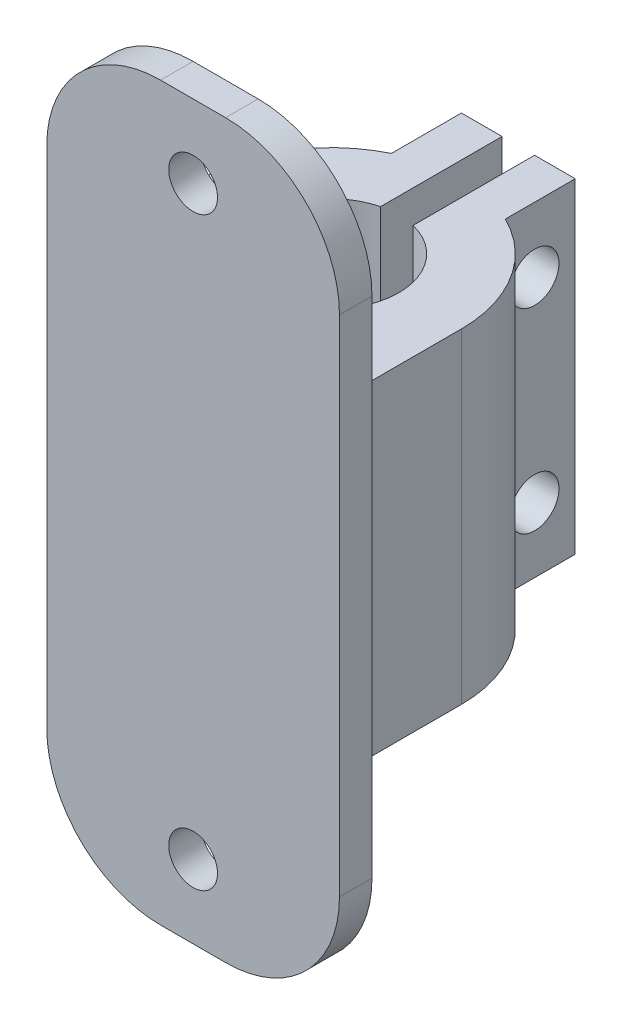
ISO-10303-21;
HEADER;
FILE_DESCRIPTION(('STEP AP214'),'2;1');
FILE_NAME('part.step','',(''),(''),'','','');
FILE_SCHEMA(('AUTOMOTIVE_DESIGN { 1 0 10303 214 1 1 1 1 }'));
ENDSEC;
DATA;
#1=APPLICATION_CONTEXT('core data for automotive mechanical design processes');
#2=APPLICATION_PROTOCOL_DEFINITION('international standard','automotive_design',2000,#1);
#3=PRODUCT_CONTEXT('',#1,'mechanical');
#4=PRODUCT('Part','Part','',(#3));
#5=PRODUCT_RELATED_PRODUCT_CATEGORY('part','',(#4));
#6=PRODUCT_DEFINITION_FORMATION('','',#4);
#7=PRODUCT_DEFINITION_CONTEXT('part definition',#1,'design');
#8=PRODUCT_DEFINITION('design','',#6,#7);
#9=PRODUCT_DEFINITION_SHAPE('','',#8);
#10=(LENGTH_UNIT() NAMED_UNIT(*) SI_UNIT(.MILLI.,.METRE.));
#11=(NAMED_UNIT(*) PLANE_ANGLE_UNIT() SI_UNIT($,.RADIAN.));
#12=(NAMED_UNIT(*) SI_UNIT($,.STERADIAN.) SOLID_ANGLE_UNIT());
#13=UNCERTAINTY_MEASURE_WITH_UNIT(LENGTH_MEASURE(1.E-05),#10,'distance_accuracy_value','');
#14=(GEOMETRIC_REPRESENTATION_CONTEXT(3) GLOBAL_UNCERTAINTY_ASSIGNED_CONTEXT((#13)) GLOBAL_UNIT_ASSIGNED_CONTEXT((#10,
#11,#12)) REPRESENTATION_CONTEXT('',''));
#15=CARTESIAN_POINT('',(0.,0.,0.));
#16=DIRECTION('',(0.,0.,1.));
#17=DIRECTION('',(1.,0.,0.));
#18=AXIS2_PLACEMENT_3D('',#15,#16,#17);
#19=CARTESIAN_POINT('',(-9.,20.,-18.));
#20=DIRECTION('',(0.,0.,1.));
#21=DIRECTION('',(1.,0.,0.));
#22=AXIS2_PLACEMENT_3D('',#19,#20,#21);
#23=PLANE('',#22);
#24=DIRECTION('',(-1.,0.,0.));
#25=VECTOR('',#24,1.);
#26=CARTESIAN_POINT('',(-9.,0.,-18.));
#27=LINE('',#26,#25);
#28=CARTESIAN_POINT('',(-1.,0.,-18.));
#29=VERTEX_POINT('',#28);
#30=CARTESIAN_POINT('',(-3.5,0.,-18.));
#31=VERTEX_POINT('',#30);
#32=EDGE_CURVE('E312',#29,#31,#27,.T.);
#33=ORIENTED_EDGE('',*,*,#32,.T.);
#34=DIRECTION('',(0.,-1.,0.));
#35=VECTOR('',#34,1.);
#36=CARTESIAN_POINT('',(-3.5,32.5,-18.));
#37=LINE('',#36,#35);
#38=CARTESIAN_POINT('',(-3.5,20.,-18.));
#39=VERTEX_POINT('',#38);
#40=EDGE_CURVE('E200',#39,#31,#37,.T.);
#41=ORIENTED_EDGE('',*,*,#40,.F.);
#42=DIRECTION('',(-1.,0.,0.));
#43=VECTOR('',#42,1.);
#44=CARTESIAN_POINT('',(-9.,20.,-18.));
#45=LINE('',#44,#43);
#46=CARTESIAN_POINT('',(-1.,20.,-18.));
#47=VERTEX_POINT('',#46);
#48=EDGE_CURVE('E306',#47,#39,#45,.T.);
#49=ORIENTED_EDGE('',*,*,#48,.F.);
#50=DIRECTION('',(0.,1.,0.));
#51=VECTOR('',#50,1.);
#52=CARTESIAN_POINT('',(-1.,0.,-18.));
#53=LINE('',#52,#51);
#54=EDGE_CURVE('E297',#29,#47,#53,.T.);
#55=ORIENTED_EDGE('',*,*,#54,.F.);
#56=EDGE_LOOP('',(#33,#41,#49,#55));
#57=FACE_BOUND('',#56,.T.);
#58=ADVANCED_FACE('F33',(#57),#23,.F.);
#59=CARTESIAN_POINT('',(0.,20.,0.));
#60=DIRECTION('',(0.,1.,0.));
#61=DIRECTION('',(0.,0.,1.));
#62=AXIS2_PLACEMENT_3D('',#59,#60,#61);
#63=PLANE('',#62);
#64=DIRECTION('',(0.,0.,-1.));
#65=VECTOR('',#64,1.);
#66=CARTESIAN_POINT('',(-3.5,20.,0.));
#67=LINE('',#66,#65);
#68=CARTESIAN_POINT('',(-3.5,20.,-13.6937472849691));
#69=VERTEX_POINT('',#68);
#70=EDGE_CURVE('E225',#69,#39,#67,.T.);
#71=ORIENTED_EDGE('',*,*,#70,.F.);
#72=CARTESIAN_POINT('',(0.,20.,-6.5));
#73=DIRECTION('',(0.,1.,0.));
#74=DIRECTION('',(0.,0.,1.));
#75=AXIS2_PLACEMENT_3D('',#72,#73,#74);
#76=CIRCLE('',#75,8.);
#77=CARTESIAN_POINT('',(-8.,20.,-6.5));
#78=VERTEX_POINT('',#77);
#79=EDGE_CURVE('E234',#78,#69,#76,.F.);
#80=ORIENTED_EDGE('',*,*,#79,.F.);
#81=DIRECTION('',(0.,0.,-1.));
#82=VECTOR('',#81,1.);
#83=CARTESIAN_POINT('',(-8.,20.,0.));
#84=LINE('',#83,#82);
#85=CARTESIAN_POINT('',(-8.,20.,0.));
#86=VERTEX_POINT('',#85);
#87=EDGE_CURVE('E174',#86,#78,#84,.T.);
#88=ORIENTED_EDGE('',*,*,#87,.F.);
#89=DIRECTION('',(1.,0.,0.));
#90=VECTOR('',#89,1.);
#91=CARTESIAN_POINT('',(-9.,20.,0.));
#92=LINE('',#91,#90);
#93=CARTESIAN_POINT('',(8.,20.,0.));
#94=VERTEX_POINT('',#93);
#95=EDGE_CURVE('E303',#86,#94,#92,.T.);
#96=ORIENTED_EDGE('',*,*,#95,.T.);
#97=DIRECTION('',(0.,0.,1.));
#98=VECTOR('',#97,1.);
#99=CARTESIAN_POINT('',(8.,20.,0.));
#100=LINE('',#99,#98);
#101=CARTESIAN_POINT('',(8.,20.,-6.5));
#102=VERTEX_POINT('',#101);
#103=EDGE_CURVE('E199',#102,#94,#100,.T.);
#104=ORIENTED_EDGE('',*,*,#103,.F.);
#105=CARTESIAN_POINT('',(0.,20.,-6.5));
#106=DIRECTION('',(0.,1.,0.));
#107=DIRECTION('',(0.,0.,1.));
#108=AXIS2_PLACEMENT_3D('',#105,#106,#107);
#109=CIRCLE('',#108,8.);
#110=CARTESIAN_POINT('',(3.5,20.,-13.6937472849691));
#111=VERTEX_POINT('',#110);
#112=EDGE_CURVE('E232',#111,#102,#109,.F.);
#113=ORIENTED_EDGE('',*,*,#112,.F.);
#114=DIRECTION('',(0.,0.,1.));
#115=VECTOR('',#114,1.);
#116=CARTESIAN_POINT('',(3.5,20.,0.));
#117=LINE('',#116,#115);
#118=CARTESIAN_POINT('',(3.5,20.,-18.));
#119=VERTEX_POINT('',#118);
#120=EDGE_CURVE('E230',#119,#111,#117,.T.);
#121=ORIENTED_EDGE('',*,*,#120,.F.);
#122=CARTESIAN_POINT('',(0.999999999999998,20.,-18.));
#123=VERTEX_POINT('',#122);
#124=EDGE_CURVE('E308',#119,#123,#45,.T.);
#125=ORIENTED_EDGE('',*,*,#124,.T.);
#126=DIRECTION('',(0.,0.,-1.));
#127=VECTOR('',#126,1.);
#128=CARTESIAN_POINT('',(1.,20.,0.));
#129=LINE('',#128,#127);
#130=CARTESIAN_POINT('',(0.999999999999999,20.,-10.5277164746293));
#131=VERTEX_POINT('',#130);
#132=EDGE_CURVE('E290',#131,#123,#129,.T.);
#133=ORIENTED_EDGE('',*,*,#132,.F.);
#134=CARTESIAN_POINT('',(0.,20.,-6.5));
#135=DIRECTION('',(0.,1.,0.));
#136=DIRECTION('',(0.,0.,1.));
#137=AXIS2_PLACEMENT_3D('',#134,#135,#136);
#138=CIRCLE('',#137,4.15);
#139=CARTESIAN_POINT('',(-1.,20.,-10.5277164746293));
#140=VERTEX_POINT('',#139);
#141=EDGE_CURVE('E277',#140,#131,#138,.T.);
#142=ORIENTED_EDGE('',*,*,#141,.F.);
#143=DIRECTION('',(0.,0.,-1.));
#144=VECTOR('',#143,1.);
#145=CARTESIAN_POINT('',(-0.999999999999999,20.,0.));
#146=LINE('',#145,#144);
#147=EDGE_CURVE('E282',#140,#47,#146,.T.);
#148=ORIENTED_EDGE('',*,*,#147,.T.);
#149=ORIENTED_EDGE('',*,*,#48,.T.);
#150=EDGE_LOOP('',(#71,#80,#88,#96,#104,#113,#121,#125,#133,#142,#148,#149));
#151=FACE_BOUND('',#150,.T.);
#152=ADVANCED_FACE('F388',(#151),#63,.T.);
#153=CARTESIAN_POINT('',(0.,0.,0.));
#154=DIRECTION('',(0.,1.,0.));
#155=DIRECTION('',(0.,0.,1.));
#156=AXIS2_PLACEMENT_3D('',#153,#154,#155);
#157=PLANE('',#156);
#158=CARTESIAN_POINT('',(0.,0.,-6.5));
#159=DIRECTION('',(0.,1.,0.));
#160=DIRECTION('',(0.,0.,1.));
#161=AXIS2_PLACEMENT_3D('',#158,#159,#160);
#162=CIRCLE('',#161,8.);
#163=CARTESIAN_POINT('',(-3.5,0.,-13.6937472849691));
#164=VERTEX_POINT('',#163);
#165=CARTESIAN_POINT('',(-8.,0.,-6.5));
#166=VERTEX_POINT('',#165);
#167=EDGE_CURVE('E181',#164,#166,#162,.T.);
#168=ORIENTED_EDGE('',*,*,#167,.F.);
#169=DIRECTION('',(0.,0.,1.));
#170=VECTOR('',#169,1.);
#171=CARTESIAN_POINT('',(-3.5,0.,-13.6937472849691));
#172=LINE('',#171,#170);
#173=EDGE_CURVE('E178',#31,#164,#172,.T.);
#174=ORIENTED_EDGE('',*,*,#173,.F.);
#175=ORIENTED_EDGE('',*,*,#32,.F.);
#176=DIRECTION('',(0.,0.,-1.));
#177=VECTOR('',#176,1.);
#178=CARTESIAN_POINT('',(-0.999999999999999,0.,0.));
#179=LINE('',#178,#177);
#180=CARTESIAN_POINT('',(-1.,0.,-10.5277164746293));
#181=VERTEX_POINT('',#180);
#182=EDGE_CURVE('E285',#181,#29,#179,.T.);
#183=ORIENTED_EDGE('',*,*,#182,.F.);
#184=CARTESIAN_POINT('',(0.,0.,-6.5));
#185=DIRECTION('',(0.,1.,0.));
#186=DIRECTION('',(0.,0.,1.));
#187=AXIS2_PLACEMENT_3D('',#184,#185,#186);
#188=CIRCLE('',#187,4.15);
#189=CARTESIAN_POINT('',(0.999999999999999,0.,-10.5277164746293));
#190=VERTEX_POINT('',#189);
#191=EDGE_CURVE('E278',#181,#190,#188,.T.);
#192=ORIENTED_EDGE('',*,*,#191,.T.);
#193=DIRECTION('',(0.,0.,-1.));
#194=VECTOR('',#193,1.);
#195=CARTESIAN_POINT('',(1.,0.,0.));
#196=LINE('',#195,#194);
#197=CARTESIAN_POINT('',(0.999999999999997,0.,-18.));
#198=VERTEX_POINT('',#197);
#199=EDGE_CURVE('E281',#190,#198,#196,.T.);
#200=ORIENTED_EDGE('',*,*,#199,.T.);
#201=CARTESIAN_POINT('',(3.5,0.,-18.));
#202=VERTEX_POINT('',#201);
#203=EDGE_CURVE('E307',#202,#198,#27,.T.);
#204=ORIENTED_EDGE('',*,*,#203,.F.);
#205=DIRECTION('',(0.,0.,-1.));
#206=VECTOR('',#205,1.);
#207=CARTESIAN_POINT('',(3.5,0.,-13.6937472849691));
#208=LINE('',#207,#206);
#209=CARTESIAN_POINT('',(3.5,0.,-13.6937472849691));
#210=VERTEX_POINT('',#209);
#211=EDGE_CURVE('E206',#210,#202,#208,.T.);
#212=ORIENTED_EDGE('',*,*,#211,.F.);
#213=CARTESIAN_POINT('',(0.,0.,-6.5));
#214=DIRECTION('',(0.,1.,0.));
#215=DIRECTION('',(0.,0.,-1.));
#216=AXIS2_PLACEMENT_3D('',#213,#214,#215);
#217=CIRCLE('',#216,8.);
#218=CARTESIAN_POINT('',(8.,0.,-6.5));
#219=VERTEX_POINT('',#218);
#220=EDGE_CURVE('E203',#219,#210,#217,.T.);
#221=ORIENTED_EDGE('',*,*,#220,.F.);
#222=DIRECTION('',(0.,0.,-1.));
#223=VECTOR('',#222,1.);
#224=CARTESIAN_POINT('',(8.,0.,0.));
#225=LINE('',#224,#223);
#226=CARTESIAN_POINT('',(8.,0.,0.));
#227=VERTEX_POINT('',#226);
#228=EDGE_CURVE('E208',#227,#219,#225,.T.);
#229=ORIENTED_EDGE('',*,*,#228,.F.);
#230=DIRECTION('',(1.,0.,0.));
#231=VECTOR('',#230,1.);
#232=CARTESIAN_POINT('',(-9.,0.,0.));
#233=LINE('',#232,#231);
#234=CARTESIAN_POINT('',(-8.,0.,0.));
#235=VERTEX_POINT('',#234);
#236=EDGE_CURVE('E194',#235,#227,#233,.T.);
#237=ORIENTED_EDGE('',*,*,#236,.F.);
#238=DIRECTION('',(0.,0.,1.));
#239=VECTOR('',#238,1.);
#240=CARTESIAN_POINT('',(-8.,0.,0.));
#241=LINE('',#240,#239);
#242=EDGE_CURVE('E50',#166,#235,#241,.T.);
#243=ORIENTED_EDGE('',*,*,#242,.F.);
#244=EDGE_LOOP('',(#168,#174,#175,#183,#192,#200,#204,#212,#221,#229,#237,#243));
#245=FACE_BOUND('',#244,.T.);
#246=ADVANCED_FACE('F191',(#245),#157,.F.);
#247=CARTESIAN_POINT('',(9.,20.,0.));
#248=DIRECTION('',(-1.,0.,0.));
#249=DIRECTION('',(0.,0.,1.));
#250=AXIS2_PLACEMENT_3D('',#247,#248,#249);
#251=PLANE('',#250);
#252=DIRECTION('',(0.,0.,-1.));
#253=VECTOR('',#252,1.);
#254=CARTESIAN_POINT('',(9.,-5.50000000000001,0.));
#255=LINE('',#254,#253);
#256=CARTESIAN_POINT('',(9.,-5.49999999999999,2.));
#257=VERTEX_POINT('',#256);
#258=CARTESIAN_POINT('',(9.,-5.49999999999999,0.));
#259=VERTEX_POINT('',#258);
#260=EDGE_CURVE('E343',#257,#259,#255,.T.);
#261=ORIENTED_EDGE('',*,*,#260,.T.);
#262=DIRECTION('',(0.,1.,0.));
#263=VECTOR('',#262,1.);
#264=CARTESIAN_POINT('',(9.,32.5,0.));
#265=LINE('',#264,#263);
#266=CARTESIAN_POINT('',(9.,25.5,0.));
#267=VERTEX_POINT('',#266);
#268=EDGE_CURVE('E246',#259,#267,#265,.T.);
#269=ORIENTED_EDGE('',*,*,#268,.T.);
#270=DIRECTION('',(0.,0.,-1.));
#271=VECTOR('',#270,1.);
#272=CARTESIAN_POINT('',(9.,25.5,0.));
#273=LINE('',#272,#271);
#274=CARTESIAN_POINT('',(9.,25.5,2.));
#275=VERTEX_POINT('',#274);
#276=EDGE_CURVE('E341',#267,#275,#273,.F.);
#277=ORIENTED_EDGE('',*,*,#276,.T.);
#278=DIRECTION('',(0.,1.,0.));
#279=VECTOR('',#278,1.);
#280=CARTESIAN_POINT('',(9.,32.5,2.));
#281=LINE('',#280,#279);
#282=EDGE_CURVE('E247',#257,#275,#281,.T.);
#283=ORIENTED_EDGE('',*,*,#282,.F.);
#284=EDGE_LOOP('',(#261,#269,#277,#283));
#285=FACE_BOUND('',#284,.T.);
#286=ADVANCED_FACE('F437',(#285),#251,.F.);
#287=ORIENTED_EDGE('',*,*,#124,.F.);
#288=DIRECTION('',(0.,-1.,0.));
#289=VECTOR('',#288,1.);
#290=CARTESIAN_POINT('',(3.5,32.5,-18.));
#291=LINE('',#290,#289);
#292=EDGE_CURVE('E215',#119,#202,#291,.T.);
#293=ORIENTED_EDGE('',*,*,#292,.T.);
#294=ORIENTED_EDGE('',*,*,#203,.T.);
#295=DIRECTION('',(0.,1.,0.));
#296=VECTOR('',#295,1.);
#297=CARTESIAN_POINT('',(0.999999999999998,0.,-18.));
#298=LINE('',#297,#296);
#299=EDGE_CURVE('E299',#198,#123,#298,.T.);
#300=ORIENTED_EDGE('',*,*,#299,.T.);
#301=EDGE_LOOP('',(#287,#293,#294,#300));
#302=FACE_BOUND('',#301,.T.);
#303=ADVANCED_FACE('F415',(#302),#23,.F.);
#304=CARTESIAN_POINT('',(-9.,20.,0.));
#305=DIRECTION('',(1.,0.,0.));
#306=DIRECTION('',(0.,0.,-1.));
#307=AXIS2_PLACEMENT_3D('',#304,#305,#306);
#308=PLANE('',#307);
#309=DIRECTION('',(0.,0.,-1.));
#310=VECTOR('',#309,1.);
#311=CARTESIAN_POINT('',(-9.,25.5,0.));
#312=LINE('',#311,#310);
#313=CARTESIAN_POINT('',(-9.,25.5,2.));
#314=VERTEX_POINT('',#313);
#315=CARTESIAN_POINT('',(-9.,25.5,0.));
#316=VERTEX_POINT('',#315);
#317=EDGE_CURVE('E328',#314,#316,#312,.T.);
#318=ORIENTED_EDGE('',*,*,#317,.T.);
#319=DIRECTION('',(0.,-1.,0.));
#320=VECTOR('',#319,1.);
#321=CARTESIAN_POINT('',(-9.,32.5,0.));
#322=LINE('',#321,#320);
#323=CARTESIAN_POINT('',(-9.,-5.49999999999999,0.));
#324=VERTEX_POINT('',#323);
#325=EDGE_CURVE('E265',#316,#324,#322,.T.);
#326=ORIENTED_EDGE('',*,*,#325,.T.);
#327=DIRECTION('',(0.,0.,-1.));
#328=VECTOR('',#327,1.);
#329=CARTESIAN_POINT('',(-9.,-5.5,0.));
#330=LINE('',#329,#328);
#331=CARTESIAN_POINT('',(-9.,-5.49999999999999,2.));
#332=VERTEX_POINT('',#331);
#333=EDGE_CURVE('E331',#324,#332,#330,.F.);
#334=ORIENTED_EDGE('',*,*,#333,.T.);
#335=DIRECTION('',(0.,-1.,0.));
#336=VECTOR('',#335,1.);
#337=CARTESIAN_POINT('',(-9.,32.5,2.));
#338=LINE('',#337,#336);
#339=EDGE_CURVE('E254',#314,#332,#338,.T.);
#340=ORIENTED_EDGE('',*,*,#339,.F.);
#341=EDGE_LOOP('',(#318,#326,#334,#340));
#342=FACE_BOUND('',#341,.T.);
#343=ADVANCED_FACE('F436',(#342),#308,.F.);
#344=CARTESIAN_POINT('',(0.,0.,-6.5));
#345=DIRECTION('',(0.,1.,0.));
#346=DIRECTION('',(0.,0.,1.));
#347=AXIS2_PLACEMENT_3D('',#344,#345,#346);
#348=CYLINDRICAL_SURFACE('',#347,4.15);
#349=ORIENTED_EDGE('',*,*,#141,.T.);
#350=DIRECTION('',(0.,1.,0.));
#351=VECTOR('',#350,1.);
#352=CARTESIAN_POINT('',(0.999999999999999,0.,-10.5277164746293));
#353=LINE('',#352,#351);
#354=EDGE_CURVE('E287',#190,#131,#353,.T.);
#355=ORIENTED_EDGE('',*,*,#354,.F.);
#356=ORIENTED_EDGE('',*,*,#191,.F.);
#357=DIRECTION('',(0.,1.,0.));
#358=VECTOR('',#357,1.);
#359=CARTESIAN_POINT('',(-1.,0.,-10.5277164746293));
#360=LINE('',#359,#358);
#361=EDGE_CURVE('E295',#181,#140,#360,.T.);
#362=ORIENTED_EDGE('',*,*,#361,.T.);
#363=EDGE_LOOP('',(#349,#355,#356,#362));
#364=FACE_BOUND('',#363,.T.);
#365=ADVANCED_FACE('F376',(#364),#348,.F.);
#366=CARTESIAN_POINT('',(-0.999999999999999,0.,0.));
#367=DIRECTION('',(1.,0.,0.));
#368=DIRECTION('',(0.,0.,-1.));
#369=AXIS2_PLACEMENT_3D('',#366,#367,#368);
#370=PLANE('',#369);
#371=CARTESIAN_POINT('',(-1.,16.,-15.5));
#372=DIRECTION('',(1.,0.,0.));
#373=DIRECTION('',(0.,0.,-1.));
#374=AXIS2_PLACEMENT_3D('',#371,#372,#373);
#375=CIRCLE('',#374,1.5);
#376=CARTESIAN_POINT('',(-1.,16.,-17.));
#377=VERTEX_POINT('',#376);
#378=EDGE_CURVE('E274',#377,#377,#375,.T.);
#379=ORIENTED_EDGE('',*,*,#378,.F.);
#380=EDGE_LOOP('',(#379));
#381=FACE_BOUND('',#380,.T.);
#382=CARTESIAN_POINT('',(-1.,4.,-15.5));
#383=DIRECTION('',(1.,0.,0.));
#384=DIRECTION('',(0.,0.,-1.));
#385=AXIS2_PLACEMENT_3D('',#382,#383,#384);
#386=CIRCLE('',#385,1.5);
#387=CARTESIAN_POINT('',(-1.,4.,-17.));
#388=VERTEX_POINT('',#387);
#389=EDGE_CURVE('E270',#388,#388,#386,.T.);
#390=ORIENTED_EDGE('',*,*,#389,.F.);
#391=EDGE_LOOP('',(#390));
#392=FACE_BOUND('',#391,.T.);
#393=ORIENTED_EDGE('',*,*,#147,.F.);
#394=ORIENTED_EDGE('',*,*,#361,.F.);
#395=ORIENTED_EDGE('',*,*,#182,.T.);
#396=ORIENTED_EDGE('',*,*,#54,.T.);
#397=EDGE_LOOP('',(#393,#394,#395,#396));
#398=FACE_BOUND('',#397,.T.);
#399=ADVANCED_FACE('F372',(#381,#392,#398),#370,.T.);
#400=CARTESIAN_POINT('',(1.,0.,0.));
#401=DIRECTION('',(1.,0.,0.));
#402=DIRECTION('',(0.,0.,-1.));
#403=AXIS2_PLACEMENT_3D('',#400,#401,#402);
#404=PLANE('',#403);
#405=CARTESIAN_POINT('',(0.999999999999997,16.,-15.5));
#406=DIRECTION('',(1.,0.,0.));
#407=DIRECTION('',(0.,0.,-1.));
#408=AXIS2_PLACEMENT_3D('',#405,#406,#407);
#409=CIRCLE('',#408,1.5);
#410=CARTESIAN_POINT('',(0.999999999999997,16.,-17.));
#411=VERTEX_POINT('',#410);
#412=EDGE_CURVE('E273',#411,#411,#409,.T.);
#413=ORIENTED_EDGE('',*,*,#412,.T.);
#414=EDGE_LOOP('',(#413));
#415=FACE_BOUND('',#414,.T.);
#416=CARTESIAN_POINT('',(0.999999999999997,4.,-15.5));
#417=DIRECTION('',(1.,0.,0.));
#418=DIRECTION('',(0.,0.,-1.));
#419=AXIS2_PLACEMENT_3D('',#416,#417,#418);
#420=CIRCLE('',#419,1.5);
#421=CARTESIAN_POINT('',(0.999999999999997,4.,-17.));
#422=VERTEX_POINT('',#421);
#423=EDGE_CURVE('E260',#422,#422,#420,.T.);
#424=ORIENTED_EDGE('',*,*,#423,.T.);
#425=EDGE_LOOP('',(#424));
#426=FACE_BOUND('',#425,.T.);
#427=ORIENTED_EDGE('',*,*,#132,.T.);
#428=ORIENTED_EDGE('',*,*,#299,.F.);
#429=ORIENTED_EDGE('',*,*,#199,.F.);
#430=ORIENTED_EDGE('',*,*,#354,.T.);
#431=EDGE_LOOP('',(#427,#428,#429,#430));
#432=FACE_BOUND('',#431,.T.);
#433=ADVANCED_FACE('F375',(#415,#426,#432),#404,.F.);
#434=CARTESIAN_POINT('',(-9.,4.,-15.5));
#435=DIRECTION('',(1.,0.,0.));
#436=DIRECTION('',(0.,0.,-1.));
#437=AXIS2_PLACEMENT_3D('',#434,#435,#436);
#438=CYLINDRICAL_SURFACE('',#437,1.5);
#439=CARTESIAN_POINT('',(3.5,4.,-15.5));
#440=DIRECTION('',(-1.,0.,0.));
#441=DIRECTION('',(0.,0.,1.));
#442=AXIS2_PLACEMENT_3D('',#439,#440,#441);
#443=CIRCLE('',#442,1.5);
#444=CARTESIAN_POINT('',(3.5,4.,-14.));
#445=VERTEX_POINT('',#444);
#446=EDGE_CURVE('E227',#445,#445,#443,.F.);
#447=ORIENTED_EDGE('',*,*,#446,.T.);
#448=EDGE_LOOP('',(#447));
#449=FACE_BOUND('',#448,.T.);
#450=ORIENTED_EDGE('',*,*,#423,.F.);
#451=EDGE_LOOP('',(#450));
#452=FACE_BOUND('',#451,.T.);
#453=ADVANCED_FACE('F369',(#449,#452),#438,.F.);
#454=CARTESIAN_POINT('',(-9.,16.,-15.5));
#455=DIRECTION('',(1.,0.,0.));
#456=DIRECTION('',(0.,0.,-1.));
#457=AXIS2_PLACEMENT_3D('',#454,#455,#456);
#458=CYLINDRICAL_SURFACE('',#457,1.5);
#459=CARTESIAN_POINT('',(3.5,16.,-15.5));
#460=DIRECTION('',(-1.,0.,0.));
#461=DIRECTION('',(0.,0.,1.));
#462=AXIS2_PLACEMENT_3D('',#459,#460,#461);
#463=CIRCLE('',#462,1.5);
#464=CARTESIAN_POINT('',(3.5,16.,-14.));
#465=VERTEX_POINT('',#464);
#466=EDGE_CURVE('E37',#465,#465,#463,.F.);
#467=ORIENTED_EDGE('',*,*,#466,.T.);
#468=EDGE_LOOP('',(#467));
#469=FACE_BOUND('',#468,.T.);
#470=ORIENTED_EDGE('',*,*,#412,.F.);
#471=EDGE_LOOP('',(#470));
#472=FACE_BOUND('',#471,.T.);
#473=ADVANCED_FACE('F367',(#469,#472),#458,.F.);
#474=CARTESIAN_POINT('',(-3.5,4.,-15.5));
#475=DIRECTION('',(1.,0.,0.));
#476=DIRECTION('',(0.,0.,-1.));
#477=AXIS2_PLACEMENT_3D('',#474,#475,#476);
#478=CIRCLE('',#477,1.5);
#479=CARTESIAN_POINT('',(-3.5,4.,-17.));
#480=VERTEX_POINT('',#479);
#481=EDGE_CURVE('E222',#480,#480,#478,.F.);
#482=ORIENTED_EDGE('',*,*,#481,.T.);
#483=EDGE_LOOP('',(#482));
#484=FACE_BOUND('',#483,.T.);
#485=ORIENTED_EDGE('',*,*,#389,.T.);
#486=EDGE_LOOP('',(#485));
#487=FACE_BOUND('',#486,.T.);
#488=ADVANCED_FACE('F364',(#484,#487),#438,.F.);
#489=CARTESIAN_POINT('',(-3.5,16.,-15.5));
#490=DIRECTION('',(1.,0.,0.));
#491=DIRECTION('',(0.,0.,-1.));
#492=AXIS2_PLACEMENT_3D('',#489,#490,#491);
#493=CIRCLE('',#492,1.5);
#494=CARTESIAN_POINT('',(-3.5,16.,-17.));
#495=VERTEX_POINT('',#494);
#496=EDGE_CURVE('E221',#495,#495,#493,.F.);
#497=ORIENTED_EDGE('',*,*,#496,.T.);
#498=EDGE_LOOP('',(#497));
#499=FACE_BOUND('',#498,.T.);
#500=ORIENTED_EDGE('',*,*,#378,.T.);
#501=EDGE_LOOP('',(#500));
#502=FACE_BOUND('',#501,.T.);
#503=ADVANCED_FACE('F353',(#499,#502),#458,.F.);
#504=CARTESIAN_POINT('',(0.,0.,0.));
#505=DIRECTION('',(0.,0.,1.));
#506=DIRECTION('',(1.,0.,0.));
#507=AXIS2_PLACEMENT_3D('',#504,#505,#506);
#508=PLANE('',#507);
#509=ORIENTED_EDGE('',*,*,#95,.F.);
#510=DIRECTION('',(0.,-1.,0.));
#511=VECTOR('',#510,1.);
#512=CARTESIAN_POINT('',(-8.,32.5,0.));
#513=LINE('',#512,#511);
#514=EDGE_CURVE('E177',#86,#235,#513,.T.);
#515=ORIENTED_EDGE('',*,*,#514,.T.);
#516=ORIENTED_EDGE('',*,*,#236,.T.);
#517=DIRECTION('',(0.,-1.,0.));
#518=VECTOR('',#517,1.);
#519=CARTESIAN_POINT('',(8.,32.5,0.));
#520=LINE('',#519,#518);
#521=EDGE_CURVE('E213',#94,#227,#520,.T.);
#522=ORIENTED_EDGE('',*,*,#521,.F.);
#523=EDGE_LOOP('',(#509,#515,#516,#522));
#524=FACE_BOUND('',#523,.T.);
#525=CARTESIAN_POINT('',(0.,-8.,0.));
#526=DIRECTION('',(0.,0.,1.));
#527=DIRECTION('',(1.,0.,0.));
#528=AXIS2_PLACEMENT_3D('',#525,#526,#527);
#529=CIRCLE('',#528,1.5);
#530=CARTESIAN_POINT('',(1.5,-8.,0.));
#531=VERTEX_POINT('',#530);
#532=EDGE_CURVE('E243',#531,#531,#529,.T.);
#533=ORIENTED_EDGE('',*,*,#532,.T.);
#534=EDGE_LOOP('',(#533));
#535=FACE_BOUND('',#534,.T.);
#536=DIRECTION('',(1.,0.,0.));
#537=VECTOR('',#536,1.);
#538=CARTESIAN_POINT('',(-9.,-12.5,0.));
#539=LINE('',#538,#537);
#540=CARTESIAN_POINT('',(-2.,-12.5,0.));
#541=VERTEX_POINT('',#540);
#542=CARTESIAN_POINT('',(2.,-12.5,0.));
#543=VERTEX_POINT('',#542);
#544=EDGE_CURVE('E251',#541,#543,#539,.T.);
#545=ORIENTED_EDGE('',*,*,#544,.F.);
#546=CARTESIAN_POINT('',(-2.,-5.5,0.));
#547=DIRECTION('',(0.,0.,1.));
#548=DIRECTION('',(1.,0.,0.));
#549=AXIS2_PLACEMENT_3D('',#546,#547,#548);
#550=CIRCLE('',#549,7.);
#551=EDGE_CURVE('E326',#541,#324,#550,.F.);
#552=ORIENTED_EDGE('',*,*,#551,.T.);
#553=ORIENTED_EDGE('',*,*,#325,.F.);
#554=CARTESIAN_POINT('',(-2.,25.5,0.));
#555=DIRECTION('',(0.,0.,1.));
#556=DIRECTION('',(1.,0.,0.));
#557=AXIS2_PLACEMENT_3D('',#554,#555,#556);
#558=CIRCLE('',#557,7.);
#559=CARTESIAN_POINT('',(-2.,32.5,0.));
#560=VERTEX_POINT('',#559);
#561=EDGE_CURVE('E58',#316,#560,#558,.F.);
#562=ORIENTED_EDGE('',*,*,#561,.T.);
#563=DIRECTION('',(-1.,0.,0.));
#564=VECTOR('',#563,1.);
#565=CARTESIAN_POINT('',(-9.,32.5,0.));
#566=LINE('',#565,#564);
#567=CARTESIAN_POINT('',(2.,32.5,0.));
#568=VERTEX_POINT('',#567);
#569=EDGE_CURVE('E263',#568,#560,#566,.T.);
#570=ORIENTED_EDGE('',*,*,#569,.F.);
#571=CARTESIAN_POINT('',(2.,25.5,0.));
#572=DIRECTION('',(0.,0.,1.));
#573=DIRECTION('',(1.,0.,0.));
#574=AXIS2_PLACEMENT_3D('',#571,#572,#573);
#575=CIRCLE('',#574,7.);
#576=EDGE_CURVE('E346',#568,#267,#575,.F.);
#577=ORIENTED_EDGE('',*,*,#576,.T.);
#578=ORIENTED_EDGE('',*,*,#268,.F.);
#579=CARTESIAN_POINT('',(2.,-5.50000000000001,0.));
#580=DIRECTION('',(0.,0.,1.));
#581=DIRECTION('',(1.,0.,0.));
#582=AXIS2_PLACEMENT_3D('',#579,#580,#581);
#583=CIRCLE('',#582,7.);
#584=EDGE_CURVE('E324',#259,#543,#583,.F.);
#585=ORIENTED_EDGE('',*,*,#584,.T.);
#586=EDGE_LOOP('',(#545,#552,#553,#562,#570,#577,#578,#585));
#587=FACE_BOUND('',#586,.T.);
#588=CARTESIAN_POINT('',(0.,28.,0.));
#589=DIRECTION('',(0.,0.,1.));
#590=DIRECTION('',(1.,0.,0.));
#591=AXIS2_PLACEMENT_3D('',#588,#589,#590);
#592=CIRCLE('',#591,1.5);
#593=CARTESIAN_POINT('',(1.5,28.,0.));
#594=VERTEX_POINT('',#593);
#595=EDGE_CURVE('E240',#594,#594,#592,.T.);
#596=ORIENTED_EDGE('',*,*,#595,.T.);
#597=EDGE_LOOP('',(#596));
#598=FACE_BOUND('',#597,.T.);
#599=ADVANCED_FACE('F400',(#524,#535,#587,#598),#508,.F.);
#600=CARTESIAN_POINT('',(-9.,32.5,2.));
#601=DIRECTION('',(0.,-1.,0.));
#602=DIRECTION('',(0.,0.,-1.));
#603=AXIS2_PLACEMENT_3D('',#600,#601,#602);
#604=PLANE('',#603);
#605=ORIENTED_EDGE('',*,*,#569,.T.);
#606=DIRECTION('',(0.,0.,-1.));
#607=VECTOR('',#606,1.);
#608=CARTESIAN_POINT('',(-2.,32.5,2.));
#609=LINE('',#608,#607);
#610=CARTESIAN_POINT('',(-2.,32.5,2.));
#611=VERTEX_POINT('',#610);
#612=EDGE_CURVE('E11',#560,#611,#609,.F.);
#613=ORIENTED_EDGE('',*,*,#612,.T.);
#614=DIRECTION('',(-1.,0.,0.));
#615=VECTOR('',#614,1.);
#616=CARTESIAN_POINT('',(-9.,32.5,2.));
#617=LINE('',#616,#615);
#618=CARTESIAN_POINT('',(2.,32.5,2.));
#619=VERTEX_POINT('',#618);
#620=EDGE_CURVE('E250',#619,#611,#617,.T.);
#621=ORIENTED_EDGE('',*,*,#620,.F.);
#622=DIRECTION('',(0.,0.,-1.));
#623=VECTOR('',#622,1.);
#624=CARTESIAN_POINT('',(2.,32.5,2.));
#625=LINE('',#624,#623);
#626=EDGE_CURVE('E42',#619,#568,#625,.T.);
#627=ORIENTED_EDGE('',*,*,#626,.T.);
#628=EDGE_LOOP('',(#605,#613,#621,#627));
#629=FACE_BOUND('',#628,.T.);
#630=ADVANCED_FACE('F488',(#629),#604,.F.);
#631=CARTESIAN_POINT('',(-9.,-12.5,2.));
#632=DIRECTION('',(0.,1.,0.));
#633=DIRECTION('',(-1.,0.,0.));
#634=AXIS2_PLACEMENT_3D('',#631,#632,#633);
#635=PLANE('',#634);
#636=DIRECTION('',(1.,0.,0.));
#637=VECTOR('',#636,1.);
#638=CARTESIAN_POINT('',(-9.,-12.5,2.));
#639=LINE('',#638,#637);
#640=CARTESIAN_POINT('',(-2.,-12.5,2.));
#641=VERTEX_POINT('',#640);
#642=CARTESIAN_POINT('',(2.,-12.5,2.));
#643=VERTEX_POINT('',#642);
#644=EDGE_CURVE('E257',#641,#643,#639,.T.);
#645=ORIENTED_EDGE('',*,*,#644,.F.);
#646=DIRECTION('',(0.,0.,-1.));
#647=VECTOR('',#646,1.);
#648=CARTESIAN_POINT('',(-2.,-12.5,2.));
#649=LINE('',#648,#647);
#650=EDGE_CURVE('E321',#641,#541,#649,.T.);
#651=ORIENTED_EDGE('',*,*,#650,.T.);
#652=ORIENTED_EDGE('',*,*,#544,.T.);
#653=DIRECTION('',(0.,0.,-1.));
#654=VECTOR('',#653,1.);
#655=CARTESIAN_POINT('',(2.,-12.5,2.));
#656=LINE('',#655,#654);
#657=EDGE_CURVE('E310',#543,#643,#656,.F.);
#658=ORIENTED_EDGE('',*,*,#657,.T.);
#659=EDGE_LOOP('',(#645,#651,#652,#658));
#660=FACE_BOUND('',#659,.T.);
#661=ADVANCED_FACE('F478',(#660),#635,.F.);
#662=CARTESIAN_POINT('',(0.,0.,2.));
#663=DIRECTION('',(0.,0.,1.));
#664=DIRECTION('',(1.,0.,0.));
#665=AXIS2_PLACEMENT_3D('',#662,#663,#664);
#666=PLANE('',#665);
#667=CARTESIAN_POINT('',(0.,28.,2.));
#668=DIRECTION('',(0.,0.,1.));
#669=DIRECTION('',(1.,0.,0.));
#670=AXIS2_PLACEMENT_3D('',#667,#668,#669);
#671=CIRCLE('',#670,1.5);
#672=CARTESIAN_POINT('',(1.5,28.,2.));
#673=VERTEX_POINT('',#672);
#674=EDGE_CURVE('E237',#673,#673,#671,.T.);
#675=ORIENTED_EDGE('',*,*,#674,.F.);
#676=EDGE_LOOP('',(#675));
#677=FACE_BOUND('',#676,.T.);
#678=CARTESIAN_POINT('',(0.,-8.,2.));
#679=DIRECTION('',(0.,0.,1.));
#680=DIRECTION('',(1.,0.,0.));
#681=AXIS2_PLACEMENT_3D('',#678,#679,#680);
#682=CIRCLE('',#681,1.5);
#683=CARTESIAN_POINT('',(1.5,-8.,2.));
#684=VERTEX_POINT('',#683);
#685=EDGE_CURVE('E236',#684,#684,#682,.T.);
#686=ORIENTED_EDGE('',*,*,#685,.F.);
#687=EDGE_LOOP('',(#686));
#688=FACE_BOUND('',#687,.T.);
#689=ORIENTED_EDGE('',*,*,#339,.T.);
#690=CARTESIAN_POINT('',(-2.,-5.5,2.));
#691=DIRECTION('',(0.,0.,1.));
#692=DIRECTION('',(1.,0.,0.));
#693=AXIS2_PLACEMENT_3D('',#690,#691,#692);
#694=CIRCLE('',#693,7.);
#695=EDGE_CURVE('E339',#332,#641,#694,.T.);
#696=ORIENTED_EDGE('',*,*,#695,.T.);
#697=ORIENTED_EDGE('',*,*,#644,.T.);
#698=CARTESIAN_POINT('',(2.,-5.50000000000001,2.));
#699=DIRECTION('',(0.,0.,1.));
#700=DIRECTION('',(1.,0.,0.));
#701=AXIS2_PLACEMENT_3D('',#698,#699,#700);
#702=CIRCLE('',#701,7.);
#703=EDGE_CURVE('E337',#643,#257,#702,.T.);
#704=ORIENTED_EDGE('',*,*,#703,.T.);
#705=ORIENTED_EDGE('',*,*,#282,.T.);
#706=CARTESIAN_POINT('',(2.,25.5,2.));
#707=DIRECTION('',(0.,0.,1.));
#708=DIRECTION('',(1.,0.,0.));
#709=AXIS2_PLACEMENT_3D('',#706,#707,#708);
#710=CIRCLE('',#709,7.);
#711=EDGE_CURVE('E333',#275,#619,#710,.T.);
#712=ORIENTED_EDGE('',*,*,#711,.T.);
#713=ORIENTED_EDGE('',*,*,#620,.T.);
#714=CARTESIAN_POINT('',(-2.,25.5,2.));
#715=DIRECTION('',(0.,0.,1.));
#716=DIRECTION('',(1.,0.,0.));
#717=AXIS2_PLACEMENT_3D('',#714,#715,#716);
#718=CIRCLE('',#717,7.);
#719=EDGE_CURVE('E335',#611,#314,#718,.T.);
#720=ORIENTED_EDGE('',*,*,#719,.T.);
#721=EDGE_LOOP('',(#689,#696,#697,#704,#705,#712,#713,#720));
#722=FACE_BOUND('',#721,.T.);
#723=ADVANCED_FACE('F470',(#677,#688,#722),#666,.T.);
#724=CARTESIAN_POINT('',(0.,28.,-18.));
#725=DIRECTION('',(0.,0.,1.));
#726=DIRECTION('',(1.,0.,0.));
#727=AXIS2_PLACEMENT_3D('',#724,#725,#726);
#728=CYLINDRICAL_SURFACE('',#727,1.5);
#729=ORIENTED_EDGE('',*,*,#674,.T.);
#730=EDGE_LOOP('',(#729));
#731=FACE_BOUND('',#730,.T.);
#732=ORIENTED_EDGE('',*,*,#595,.F.);
#733=EDGE_LOOP('',(#732));
#734=FACE_BOUND('',#733,.T.);
#735=ADVANCED_FACE('F494',(#731,#734),#728,.F.);
#736=CARTESIAN_POINT('',(0.,-8.,-18.));
#737=DIRECTION('',(0.,0.,1.));
#738=DIRECTION('',(1.,0.,0.));
#739=AXIS2_PLACEMENT_3D('',#736,#737,#738);
#740=CYLINDRICAL_SURFACE('',#739,1.5);
#741=ORIENTED_EDGE('',*,*,#685,.T.);
#742=EDGE_LOOP('',(#741));
#743=FACE_BOUND('',#742,.T.);
#744=ORIENTED_EDGE('',*,*,#532,.F.);
#745=EDGE_LOOP('',(#744));
#746=FACE_BOUND('',#745,.T.);
#747=ADVANCED_FACE('F453',(#743,#746),#740,.F.);
#748=CARTESIAN_POINT('',(-2.,-5.5,2.));
#749=DIRECTION('',(0.,0.,-1.));
#750=DIRECTION('',(-1.,0.,0.));
#751=AXIS2_PLACEMENT_3D('',#748,#749,#750);
#752=CYLINDRICAL_SURFACE('',#751,7.);
#753=ORIENTED_EDGE('',*,*,#695,.F.);
#754=ORIENTED_EDGE('',*,*,#333,.F.);
#755=ORIENTED_EDGE('',*,*,#551,.F.);
#756=ORIENTED_EDGE('',*,*,#650,.F.);
#757=EDGE_LOOP('',(#753,#754,#755,#756));
#758=FACE_BOUND('',#757,.T.);
#759=ADVANCED_FACE('F449',(#758),#752,.T.);
#760=CARTESIAN_POINT('',(2.,-5.50000000000001,0.));
#761=DIRECTION('',(0.,0.,-1.));
#762=DIRECTION('',(-1.,0.,0.));
#763=AXIS2_PLACEMENT_3D('',#760,#761,#762);
#764=CYLINDRICAL_SURFACE('',#763,7.);
#765=ORIENTED_EDGE('',*,*,#703,.F.);
#766=ORIENTED_EDGE('',*,*,#657,.F.);
#767=ORIENTED_EDGE('',*,*,#584,.F.);
#768=ORIENTED_EDGE('',*,*,#260,.F.);
#769=EDGE_LOOP('',(#765,#766,#767,#768));
#770=FACE_BOUND('',#769,.T.);
#771=ADVANCED_FACE('F452',(#770),#764,.T.);
#772=CARTESIAN_POINT('',(-2.,25.5,0.));
#773=DIRECTION('',(0.,0.,-1.));
#774=DIRECTION('',(-1.,0.,0.));
#775=AXIS2_PLACEMENT_3D('',#772,#773,#774);
#776=CYLINDRICAL_SURFACE('',#775,7.);
#777=ORIENTED_EDGE('',*,*,#719,.F.);
#778=ORIENTED_EDGE('',*,*,#612,.F.);
#779=ORIENTED_EDGE('',*,*,#561,.F.);
#780=ORIENTED_EDGE('',*,*,#317,.F.);
#781=EDGE_LOOP('',(#777,#778,#779,#780));
#782=FACE_BOUND('',#781,.T.);
#783=ADVANCED_FACE('F456',(#782),#776,.T.);
#784=CARTESIAN_POINT('',(2.,25.5,2.));
#785=DIRECTION('',(0.,0.,-1.));
#786=DIRECTION('',(-1.,0.,0.));
#787=AXIS2_PLACEMENT_3D('',#784,#785,#786);
#788=CYLINDRICAL_SURFACE('',#787,7.);
#789=ORIENTED_EDGE('',*,*,#711,.F.);
#790=ORIENTED_EDGE('',*,*,#276,.F.);
#791=ORIENTED_EDGE('',*,*,#576,.F.);
#792=ORIENTED_EDGE('',*,*,#626,.F.);
#793=EDGE_LOOP('',(#789,#790,#791,#792));
#794=FACE_BOUND('',#793,.T.);
#795=ADVANCED_FACE('F35',(#794),#788,.T.);
#796=CARTESIAN_POINT('',(3.5,32.5,-13.6937472849691));
#797=DIRECTION('',(-1.,0.,0.));
#798=DIRECTION('',(0.,0.,1.));
#799=AXIS2_PLACEMENT_3D('',#796,#797,#798);
#800=PLANE('',#799);
#801=ORIENTED_EDGE('',*,*,#120,.T.);
#802=DIRECTION('',(0.,-1.,0.));
#803=VECTOR('',#802,1.);
#804=CARTESIAN_POINT('',(3.5,32.5,-13.6937472849691));
#805=LINE('',#804,#803);
#806=EDGE_CURVE('E211',#111,#210,#805,.T.);
#807=ORIENTED_EDGE('',*,*,#806,.T.);
#808=ORIENTED_EDGE('',*,*,#211,.T.);
#809=ORIENTED_EDGE('',*,*,#292,.F.);
#810=EDGE_LOOP('',(#801,#807,#808,#809));
#811=FACE_BOUND('',#810,.T.);
#812=ORIENTED_EDGE('',*,*,#466,.F.);
#813=EDGE_LOOP('',(#812));
#814=FACE_BOUND('',#813,.T.);
#815=ORIENTED_EDGE('',*,*,#446,.F.);
#816=EDGE_LOOP('',(#815));
#817=FACE_BOUND('',#816,.T.);
#818=ADVANCED_FACE('F463',(#811,#814,#817),#800,.F.);
#819=CARTESIAN_POINT('',(0.,32.5,-6.5));
#820=DIRECTION('',(0.,-1.,0.));
#821=DIRECTION('',(0.,0.,-1.));
#822=AXIS2_PLACEMENT_3D('',#819,#820,#821);
#823=CYLINDRICAL_SURFACE('',#822,8.);
#824=ORIENTED_EDGE('',*,*,#112,.T.);
#825=DIRECTION('',(0.,-1.,0.));
#826=VECTOR('',#825,1.);
#827=CARTESIAN_POINT('',(8.,32.5,-6.5));
#828=LINE('',#827,#826);
#829=EDGE_CURVE('E188',#102,#219,#828,.T.);
#830=ORIENTED_EDGE('',*,*,#829,.T.);
#831=ORIENTED_EDGE('',*,*,#220,.T.);
#832=ORIENTED_EDGE('',*,*,#806,.F.);
#833=EDGE_LOOP('',(#824,#830,#831,#832));
#834=FACE_BOUND('',#833,.T.);
#835=ADVANCED_FACE('F409',(#834),#823,.T.);
#836=CARTESIAN_POINT('',(8.,32.5,0.));
#837=DIRECTION('',(-1.,0.,0.));
#838=DIRECTION('',(0.,0.,1.));
#839=AXIS2_PLACEMENT_3D('',#836,#837,#838);
#840=PLANE('',#839);
#841=ORIENTED_EDGE('',*,*,#103,.T.);
#842=ORIENTED_EDGE('',*,*,#521,.T.);
#843=ORIENTED_EDGE('',*,*,#228,.T.);
#844=ORIENTED_EDGE('',*,*,#829,.F.);
#845=EDGE_LOOP('',(#841,#842,#843,#844));
#846=FACE_BOUND('',#845,.T.);
#847=ADVANCED_FACE('F359',(#846),#840,.F.);
#848=CARTESIAN_POINT('',(-3.5,32.5,-13.6937472849691));
#849=DIRECTION('',(1.,0.,0.));
#850=DIRECTION('',(0.,0.,-1.));
#851=AXIS2_PLACEMENT_3D('',#848,#849,#850);
#852=PLANE('',#851);
#853=ORIENTED_EDGE('',*,*,#70,.T.);
#854=ORIENTED_EDGE('',*,*,#40,.T.);
#855=ORIENTED_EDGE('',*,*,#173,.T.);
#856=DIRECTION('',(0.,-1.,0.));
#857=VECTOR('',#856,1.);
#858=CARTESIAN_POINT('',(-3.5,32.5,-13.6937472849691));
#859=LINE('',#858,#857);
#860=EDGE_CURVE('E184',#69,#164,#859,.T.);
#861=ORIENTED_EDGE('',*,*,#860,.F.);
#862=EDGE_LOOP('',(#853,#854,#855,#861));
#863=FACE_BOUND('',#862,.T.);
#864=ORIENTED_EDGE('',*,*,#496,.F.);
#865=EDGE_LOOP('',(#864));
#866=FACE_BOUND('',#865,.T.);
#867=ORIENTED_EDGE('',*,*,#481,.F.);
#868=EDGE_LOOP('',(#867));
#869=FACE_BOUND('',#868,.T.);
#870=ADVANCED_FACE('F356',(#863,#866,#869),#852,.F.);
#871=CARTESIAN_POINT('',(0.,32.5,-6.5));
#872=DIRECTION('',(0.,-1.,0.));
#873=DIRECTION('',(0.,0.,-1.));
#874=AXIS2_PLACEMENT_3D('',#871,#872,#873);
#875=CYLINDRICAL_SURFACE('',#874,8.);
#876=ORIENTED_EDGE('',*,*,#79,.T.);
#877=ORIENTED_EDGE('',*,*,#860,.T.);
#878=ORIENTED_EDGE('',*,*,#167,.T.);
#879=DIRECTION('',(0.,-1.,0.));
#880=VECTOR('',#879,1.);
#881=CARTESIAN_POINT('',(-8.,32.5,-6.5));
#882=LINE('',#881,#880);
#883=EDGE_CURVE('E170',#78,#166,#882,.T.);
#884=ORIENTED_EDGE('',*,*,#883,.F.);
#885=EDGE_LOOP('',(#876,#877,#878,#884));
#886=FACE_BOUND('',#885,.T.);
#887=ADVANCED_FACE('F182',(#886),#875,.T.);
#888=CARTESIAN_POINT('',(-8.,32.5,0.));
#889=DIRECTION('',(1.,0.,0.));
#890=DIRECTION('',(0.,0.,-1.));
#891=AXIS2_PLACEMENT_3D('',#888,#889,#890);
#892=PLANE('',#891);
#893=ORIENTED_EDGE('',*,*,#87,.T.);
#894=ORIENTED_EDGE('',*,*,#883,.T.);
#895=ORIENTED_EDGE('',*,*,#242,.T.);
#896=ORIENTED_EDGE('',*,*,#514,.F.);
#897=EDGE_LOOP('',(#893,#894,#895,#896));
#898=FACE_BOUND('',#897,.T.);
#899=ADVANCED_FACE('F172',(#898),#892,.F.);
#900=CLOSED_SHELL('',(#58,#152,#246,#286,#303,#343,#365,#399,#433,#453,#473,#488,#503,#599,#630,
#661,#723,#735,#747,#759,#771,#783,#795,#818,#835,#847,#870,#887,#899));
#901=MANIFOLD_SOLID_BREP('B2',#900);
#902=ADVANCED_BREP_SHAPE_REPRESENTATION('',(#18,#901),#14);
#903=SHAPE_DEFINITION_REPRESENTATION(#9,#902);
ENDSEC;
END-ISO-10303-21;
